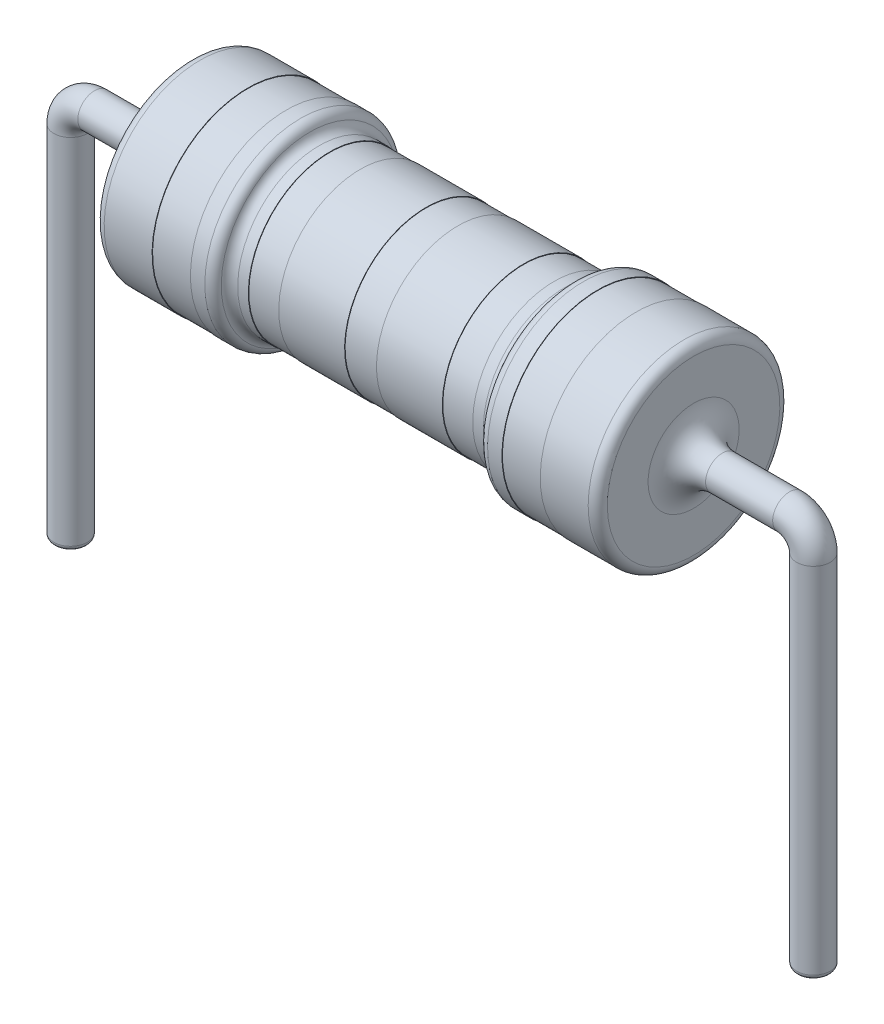
ISO-10303-21;
HEADER;
FILE_DESCRIPTION(('STEP AP214'),'2;1');
FILE_NAME('part.step','',(''),(''),'','','');
FILE_SCHEMA(('AUTOMOTIVE_DESIGN { 1 0 10303 214 1 1 1 1 }'));
ENDSEC;
DATA;
#1=APPLICATION_CONTEXT('core data for automotive mechanical design processes');
#2=APPLICATION_PROTOCOL_DEFINITION('international standard','automotive_design',2000,#1);
#3=PRODUCT_CONTEXT('',#1,'mechanical');
#4=PRODUCT('Part','Part','',(#3));
#5=PRODUCT_RELATED_PRODUCT_CATEGORY('part','',(#4));
#6=PRODUCT_DEFINITION_FORMATION('','',#4);
#7=PRODUCT_DEFINITION_CONTEXT('part definition',#1,'design');
#8=PRODUCT_DEFINITION('design','',#6,#7);
#9=PRODUCT_DEFINITION_SHAPE('','',#8);
#10=(LENGTH_UNIT() NAMED_UNIT(*) SI_UNIT(.MILLI.,.METRE.));
#11=(NAMED_UNIT(*) PLANE_ANGLE_UNIT() SI_UNIT($,.RADIAN.));
#12=(NAMED_UNIT(*) SI_UNIT($,.STERADIAN.) SOLID_ANGLE_UNIT());
#13=UNCERTAINTY_MEASURE_WITH_UNIT(LENGTH_MEASURE(1.E-05),#10,'distance_accuracy_value','');
#14=(GEOMETRIC_REPRESENTATION_CONTEXT(3) GLOBAL_UNCERTAINTY_ASSIGNED_CONTEXT((#13)) GLOBAL_UNIT_ASSIGNED_CONTEXT((#10,
#11,#12)) REPRESENTATION_CONTEXT('',''));
#15=CARTESIAN_POINT('',(0.,0.,0.));
#16=DIRECTION('',(0.,0.,1.));
#17=DIRECTION('',(1.,0.,0.));
#18=AXIS2_PLACEMENT_3D('',#15,#16,#17);
#19=CARTESIAN_POINT('',(5.25,0.,0.));
#20=DIRECTION('',(1.,0.,0.));
#21=DIRECTION('',(0.,1.,0.));
#22=AXIS2_PLACEMENT_3D('',#19,#20,#21);
#23=PLANE('',#22);
#24=CARTESIAN_POINT('',(5.25,0.,0.));
#25=DIRECTION('',(1.,0.,0.));
#26=DIRECTION('',(0.,1.,0.));
#27=AXIS2_PLACEMENT_3D('',#24,#25,#26);
#28=CIRCLE('',#27,0.95);
#29=CARTESIAN_POINT('',(5.25,0.95,0.));
#30=VERTEX_POINT('',#29);
#31=EDGE_CURVE('E51',#30,#30,#28,.F.);
#32=ORIENTED_EDGE('',*,*,#31,.T.);
#33=EDGE_LOOP('',(#32));
#34=FACE_BOUND('',#33,.T.);
#35=CARTESIAN_POINT('',(5.25,0.,0.));
#36=DIRECTION('',(1.,0.,0.));
#37=DIRECTION('',(0.,1.,0.));
#38=AXIS2_PLACEMENT_3D('',#35,#36,#37);
#39=CIRCLE('',#38,1.8);
#40=CARTESIAN_POINT('',(5.25,1.8,0.));
#41=VERTEX_POINT('',#40);
#42=EDGE_CURVE('E79',#41,#41,#39,.T.);
#43=ORIENTED_EDGE('',*,*,#42,.T.);
#44=EDGE_LOOP('',(#43));
#45=FACE_BOUND('',#44,.T.);
#46=ADVANCED_FACE('F36',(#34,#45),#23,.T.);
#47=CARTESIAN_POINT('',(-5.25,0.,0.));
#48=DIRECTION('',(-1.,0.,0.));
#49=DIRECTION('',(0.,-1.,0.));
#50=AXIS2_PLACEMENT_3D('',#47,#48,#49);
#51=CYLINDRICAL_SURFACE('',#50,2.);
#52=CARTESIAN_POINT('',(5.05,0.,0.));
#53=DIRECTION('',(1.,0.,0.));
#54=DIRECTION('',(0.,1.,0.));
#55=AXIS2_PLACEMENT_3D('',#52,#53,#54);
#56=CIRCLE('',#55,2.);
#57=CARTESIAN_POINT('',(5.05,2.,0.));
#58=VERTEX_POINT('',#57);
#59=EDGE_CURVE('E83',#58,#58,#56,.F.);
#60=ORIENTED_EDGE('',*,*,#59,.T.);
#61=EDGE_LOOP('',(#60));
#62=FACE_BOUND('',#61,.T.);
#63=CARTESIAN_POINT('',(4.05,0.,0.));
#64=DIRECTION('',(-1.,0.,0.));
#65=DIRECTION('',(0.,-1.,0.));
#66=AXIS2_PLACEMENT_3D('',#63,#64,#65);
#67=CIRCLE('',#66,2.);
#68=CARTESIAN_POINT('',(4.05,-2.,0.));
#69=VERTEX_POINT('',#68);
#70=EDGE_CURVE('E118',#69,#69,#67,.T.);
#71=ORIENTED_EDGE('',*,*,#70,.F.);
#72=EDGE_LOOP('',(#71));
#73=FACE_BOUND('',#72,.T.);
#74=ADVANCED_FACE('F233',(#62,#73),#51,.T.);
#75=CARTESIAN_POINT('',(4.05,-2.,0.));
#76=DIRECTION('',(-1.,0.,0.));
#77=DIRECTION('',(0.,-1.,0.));
#78=AXIS2_PLACEMENT_3D('',#75,#76,#77);
#79=PLANE('',#78);
#80=ORIENTED_EDGE('',*,*,#70,.T.);
#81=EDGE_LOOP('',(#80));
#82=FACE_BOUND('',#81,.T.);
#83=CARTESIAN_POINT('',(4.05,0.,0.));
#84=DIRECTION('',(-1.,0.,0.));
#85=DIRECTION('',(0.,-1.,0.));
#86=AXIS2_PLACEMENT_3D('',#83,#84,#85);
#87=CIRCLE('',#86,1.99);
#88=CARTESIAN_POINT('',(4.05,-1.99,0.));
#89=VERTEX_POINT('',#88);
#90=EDGE_CURVE('E122',#89,#89,#87,.T.);
#91=ORIENTED_EDGE('',*,*,#90,.F.);
#92=EDGE_LOOP('',(#91));
#93=FACE_BOUND('',#92,.T.);
#94=ADVANCED_FACE('F239',(#82,#93),#79,.T.);
#95=CARTESIAN_POINT('',(-5.25,0.,0.));
#96=DIRECTION('',(-1.,0.,0.));
#97=DIRECTION('',(0.,-1.,0.));
#98=AXIS2_PLACEMENT_3D('',#95,#96,#97);
#99=CYLINDRICAL_SURFACE('',#98,1.99);
#100=ORIENTED_EDGE('',*,*,#90,.T.);
#101=EDGE_LOOP('',(#100));
#102=FACE_BOUND('',#101,.T.);
#103=CARTESIAN_POINT('',(3.25,0.,0.));
#104=DIRECTION('',(-1.,0.,0.));
#105=DIRECTION('',(0.,-1.,0.));
#106=AXIS2_PLACEMENT_3D('',#103,#104,#105);
#107=CIRCLE('',#106,1.99);
#108=CARTESIAN_POINT('',(3.25,-1.99,0.));
#109=VERTEX_POINT('',#108);
#110=EDGE_CURVE('E126',#109,#109,#107,.T.);
#111=ORIENTED_EDGE('',*,*,#110,.F.);
#112=EDGE_LOOP('',(#111));
#113=FACE_BOUND('',#112,.T.);
#114=ADVANCED_FACE('F388',(#102,#113),#99,.T.);
#115=CARTESIAN_POINT('',(3.25,-1.99,0.));
#116=DIRECTION('',(1.,0.,0.));
#117=DIRECTION('',(0.,1.,0.));
#118=AXIS2_PLACEMENT_3D('',#115,#116,#117);
#119=PLANE('',#118);
#120=ORIENTED_EDGE('',*,*,#110,.T.);
#121=EDGE_LOOP('',(#120));
#122=FACE_BOUND('',#121,.T.);
#123=CARTESIAN_POINT('',(3.25,0.,0.));
#124=DIRECTION('',(-1.,0.,0.));
#125=DIRECTION('',(0.,-1.,0.));
#126=AXIS2_PLACEMENT_3D('',#123,#124,#125);
#127=CIRCLE('',#126,2.);
#128=CARTESIAN_POINT('',(3.25,-2.,0.));
#129=VERTEX_POINT('',#128);
#130=EDGE_CURVE('E130',#129,#129,#127,.T.);
#131=ORIENTED_EDGE('',*,*,#130,.F.);
#132=EDGE_LOOP('',(#131));
#133=FACE_BOUND('',#132,.T.);
#134=ADVANCED_FACE('F384',(#122,#133),#119,.T.);
#135=CARTESIAN_POINT('',(-5.25,0.,0.));
#136=DIRECTION('',(-1.,0.,0.));
#137=DIRECTION('',(0.,-1.,0.));
#138=AXIS2_PLACEMENT_3D('',#135,#136,#137);
#139=CYLINDRICAL_SURFACE('',#138,2.);
#140=CARTESIAN_POINT('',(2.95,0.,0.));
#141=DIRECTION('',(-1.,0.,0.));
#142=DIRECTION('',(0.,-1.,0.));
#143=AXIS2_PLACEMENT_3D('',#140,#141,#142);
#144=CIRCLE('',#143,2.);
#145=CARTESIAN_POINT('',(2.95,-2.,0.));
#146=VERTEX_POINT('',#145);
#147=EDGE_CURVE('E102',#146,#146,#144,.F.);
#148=ORIENTED_EDGE('',*,*,#147,.T.);
#149=EDGE_LOOP('',(#148));
#150=FACE_BOUND('',#149,.T.);
#151=ORIENTED_EDGE('',*,*,#130,.T.);
#152=EDGE_LOOP('',(#151));
#153=FACE_BOUND('',#152,.T.);
#154=ADVANCED_FACE('F380',(#150,#153),#139,.T.);
#155=CARTESIAN_POINT('',(-5.25,0.,0.));
#156=DIRECTION('',(-1.,0.,0.));
#157=DIRECTION('',(0.,-1.,0.));
#158=AXIS2_PLACEMENT_3D('',#155,#156,#157);
#159=CYLINDRICAL_SURFACE('',#158,1.7);
#160=CARTESIAN_POINT('',(2.5627016653792,0.,0.));
#161=DIRECTION('',(-1.,0.,0.));
#162=DIRECTION('',(0.,-1.,0.));
#163=AXIS2_PLACEMENT_3D('',#160,#161,#162);
#164=CIRCLE('',#163,1.7);
#165=CARTESIAN_POINT('',(2.5627016653792,-1.7,0.));
#166=VERTEX_POINT('',#165);
#167=EDGE_CURVE('E99',#166,#166,#164,.T.);
#168=ORIENTED_EDGE('',*,*,#167,.T.);
#169=EDGE_LOOP('',(#168));
#170=FACE_BOUND('',#169,.T.);
#171=CARTESIAN_POINT('',(2.34069006093189,0.,0.));
#172=DIRECTION('',(-1.,0.,0.));
#173=DIRECTION('',(0.,-1.,0.));
#174=AXIS2_PLACEMENT_3D('',#171,#172,#173);
#175=CIRCLE('',#174,1.7);
#176=CARTESIAN_POINT('',(2.34069006093189,-1.7,0.));
#177=VERTEX_POINT('',#176);
#178=EDGE_CURVE('E134',#177,#177,#175,.T.);
#179=ORIENTED_EDGE('',*,*,#178,.F.);
#180=EDGE_LOOP('',(#179));
#181=FACE_BOUND('',#180,.T.);
#182=ADVANCED_FACE('F376',(#170,#181),#159,.T.);
#183=CARTESIAN_POINT('',(2.3406900609319,-1.7,0.));
#184=DIRECTION('',(-1.,0.,0.));
#185=DIRECTION('',(0.,-1.,0.));
#186=AXIS2_PLACEMENT_3D('',#183,#184,#185);
#187=PLANE('',#186);
#188=ORIENTED_EDGE('',*,*,#178,.T.);
#189=EDGE_LOOP('',(#188));
#190=FACE_BOUND('',#189,.T.);
#191=CARTESIAN_POINT('',(2.34069006093189,0.,0.));
#192=DIRECTION('',(-1.,0.,0.));
#193=DIRECTION('',(0.,-1.,0.));
#194=AXIS2_PLACEMENT_3D('',#191,#192,#193);
#195=CIRCLE('',#194,1.69);
#196=CARTESIAN_POINT('',(2.34069006093189,-1.69,0.));
#197=VERTEX_POINT('',#196);
#198=EDGE_CURVE('E138',#197,#197,#195,.T.);
#199=ORIENTED_EDGE('',*,*,#198,.F.);
#200=EDGE_LOOP('',(#199));
#201=FACE_BOUND('',#200,.T.);
#202=ADVANCED_FACE('F372',(#190,#201),#187,.T.);
#203=CARTESIAN_POINT('',(-5.25,0.,0.));
#204=DIRECTION('',(-1.,0.,0.));
#205=DIRECTION('',(0.,-1.,0.));
#206=AXIS2_PLACEMENT_3D('',#203,#204,#205);
#207=CYLINDRICAL_SURFACE('',#206,1.69);
#208=ORIENTED_EDGE('',*,*,#198,.T.);
#209=EDGE_LOOP('',(#208));
#210=FACE_BOUND('',#209,.T.);
#211=CARTESIAN_POINT('',(1.70680528042174,0.,0.));
#212=DIRECTION('',(-1.,0.,0.));
#213=DIRECTION('',(0.,-1.,0.));
#214=AXIS2_PLACEMENT_3D('',#211,#212,#213);
#215=CIRCLE('',#214,1.69);
#216=CARTESIAN_POINT('',(1.70680528042174,-1.69,0.));
#217=VERTEX_POINT('',#216);
#218=EDGE_CURVE('E142',#217,#217,#215,.T.);
#219=ORIENTED_EDGE('',*,*,#218,.F.);
#220=EDGE_LOOP('',(#219));
#221=FACE_BOUND('',#220,.T.);
#222=ADVANCED_FACE('F368',(#210,#221),#207,.T.);
#223=CARTESIAN_POINT('',(1.70680528042174,-1.69,0.));
#224=DIRECTION('',(1.,0.,0.));
#225=DIRECTION('',(0.,1.,0.));
#226=AXIS2_PLACEMENT_3D('',#223,#224,#225);
#227=PLANE('',#226);
#228=ORIENTED_EDGE('',*,*,#218,.T.);
#229=EDGE_LOOP('',(#228));
#230=FACE_BOUND('',#229,.T.);
#231=CARTESIAN_POINT('',(1.70680528042174,0.,0.));
#232=DIRECTION('',(-1.,0.,0.));
#233=DIRECTION('',(0.,-1.,0.));
#234=AXIS2_PLACEMENT_3D('',#231,#232,#233);
#235=CIRCLE('',#234,1.7);
#236=CARTESIAN_POINT('',(1.70680528042174,-1.7,0.));
#237=VERTEX_POINT('',#236);
#238=EDGE_CURVE('E146',#237,#237,#235,.T.);
#239=ORIENTED_EDGE('',*,*,#238,.F.);
#240=EDGE_LOOP('',(#239));
#241=FACE_BOUND('',#240,.T.);
#242=ADVANCED_FACE('F364',(#230,#241),#227,.T.);
#243=CARTESIAN_POINT('',(-5.25,0.,0.));
#244=DIRECTION('',(-1.,0.,0.));
#245=DIRECTION('',(0.,-1.,0.));
#246=AXIS2_PLACEMENT_3D('',#243,#244,#245);
#247=CYLINDRICAL_SURFACE('',#246,1.7);
#248=ORIENTED_EDGE('',*,*,#238,.T.);
#249=EDGE_LOOP('',(#248));
#250=FACE_BOUND('',#249,.T.);
#251=CARTESIAN_POINT('',(0.332543076275725,0.,0.));
#252=DIRECTION('',(-1.,0.,0.));
#253=DIRECTION('',(0.,-1.,0.));
#254=AXIS2_PLACEMENT_3D('',#251,#252,#253);
#255=CIRCLE('',#254,1.7);
#256=CARTESIAN_POINT('',(0.332543076275725,-1.7,0.));
#257=VERTEX_POINT('',#256);
#258=EDGE_CURVE('E150',#257,#257,#255,.T.);
#259=ORIENTED_EDGE('',*,*,#258,.F.);
#260=EDGE_LOOP('',(#259));
#261=FACE_BOUND('',#260,.T.);
#262=ADVANCED_FACE('F360',(#250,#261),#247,.T.);
#263=CARTESIAN_POINT('',(0.332543076275725,-1.7,0.));
#264=DIRECTION('',(-1.,0.,0.));
#265=DIRECTION('',(0.,-1.,0.));
#266=AXIS2_PLACEMENT_3D('',#263,#264,#265);
#267=PLANE('',#266);
#268=ORIENTED_EDGE('',*,*,#258,.T.);
#269=EDGE_LOOP('',(#268));
#270=FACE_BOUND('',#269,.T.);
#271=CARTESIAN_POINT('',(0.332543076275725,0.,0.));
#272=DIRECTION('',(-1.,0.,0.));
#273=DIRECTION('',(0.,-1.,0.));
#274=AXIS2_PLACEMENT_3D('',#271,#272,#273);
#275=CIRCLE('',#274,1.69);
#276=CARTESIAN_POINT('',(0.332543076275725,-1.69,0.));
#277=VERTEX_POINT('',#276);
#278=EDGE_CURVE('E154',#277,#277,#275,.T.);
#279=ORIENTED_EDGE('',*,*,#278,.F.);
#280=EDGE_LOOP('',(#279));
#281=FACE_BOUND('',#280,.T.);
#282=ADVANCED_FACE('F356',(#270,#281),#267,.T.);
#283=CARTESIAN_POINT('',(-5.25,0.,0.));
#284=DIRECTION('',(-1.,0.,0.));
#285=DIRECTION('',(0.,-1.,0.));
#286=AXIS2_PLACEMENT_3D('',#283,#284,#285);
#287=CYLINDRICAL_SURFACE('',#286,1.69);
#288=ORIENTED_EDGE('',*,*,#278,.T.);
#289=EDGE_LOOP('',(#288));
#290=FACE_BOUND('',#289,.T.);
#291=CARTESIAN_POINT('',(-0.332543076275725,0.,0.));
#292=DIRECTION('',(-1.,0.,0.));
#293=DIRECTION('',(0.,-1.,0.));
#294=AXIS2_PLACEMENT_3D('',#291,#292,#293);
#295=CIRCLE('',#294,1.69);
#296=CARTESIAN_POINT('',(-0.332543076275725,-1.69,0.));
#297=VERTEX_POINT('',#296);
#298=EDGE_CURVE('E158',#297,#297,#295,.T.);
#299=ORIENTED_EDGE('',*,*,#298,.F.);
#300=EDGE_LOOP('',(#299));
#301=FACE_BOUND('',#300,.T.);
#302=ADVANCED_FACE('F352',(#290,#301),#287,.T.);
#303=CARTESIAN_POINT('',(-0.332543076275725,-1.7,0.));
#304=DIRECTION('',(1.,0.,0.));
#305=DIRECTION('',(0.,1.,0.));
#306=AXIS2_PLACEMENT_3D('',#303,#304,#305);
#307=PLANE('',#306);
#308=ORIENTED_EDGE('',*,*,#298,.T.);
#309=EDGE_LOOP('',(#308));
#310=FACE_BOUND('',#309,.T.);
#311=CARTESIAN_POINT('',(-0.332543076275725,0.,0.));
#312=DIRECTION('',(-1.,0.,0.));
#313=DIRECTION('',(0.,-1.,0.));
#314=AXIS2_PLACEMENT_3D('',#311,#312,#313);
#315=CIRCLE('',#314,1.7);
#316=CARTESIAN_POINT('',(-0.332543076275725,-1.7,0.));
#317=VERTEX_POINT('',#316);
#318=EDGE_CURVE('E162',#317,#317,#315,.T.);
#319=ORIENTED_EDGE('',*,*,#318,.F.);
#320=EDGE_LOOP('',(#319));
#321=FACE_BOUND('',#320,.T.);
#322=ADVANCED_FACE('F348',(#310,#321),#307,.T.);
#323=CARTESIAN_POINT('',(-5.25,0.,0.));
#324=DIRECTION('',(-1.,0.,0.));
#325=DIRECTION('',(0.,-1.,0.));
#326=AXIS2_PLACEMENT_3D('',#323,#324,#325);
#327=CYLINDRICAL_SURFACE('',#326,1.7);
#328=ORIENTED_EDGE('',*,*,#318,.T.);
#329=EDGE_LOOP('',(#328));
#330=FACE_BOUND('',#329,.T.);
#331=CARTESIAN_POINT('',(-1.70680528042174,0.,0.));
#332=DIRECTION('',(-1.,0.,0.));
#333=DIRECTION('',(0.,-1.,0.));
#334=AXIS2_PLACEMENT_3D('',#331,#332,#333);
#335=CIRCLE('',#334,1.7);
#336=CARTESIAN_POINT('',(-1.70680528042174,-1.7,0.));
#337=VERTEX_POINT('',#336);
#338=EDGE_CURVE('E166',#337,#337,#335,.T.);
#339=ORIENTED_EDGE('',*,*,#338,.F.);
#340=EDGE_LOOP('',(#339));
#341=FACE_BOUND('',#340,.T.);
#342=ADVANCED_FACE('F344',(#330,#341),#327,.T.);
#343=CARTESIAN_POINT('',(-1.70680528042174,-1.69,0.));
#344=DIRECTION('',(-1.,0.,0.));
#345=DIRECTION('',(0.,-1.,0.));
#346=AXIS2_PLACEMENT_3D('',#343,#344,#345);
#347=PLANE('',#346);
#348=ORIENTED_EDGE('',*,*,#338,.T.);
#349=EDGE_LOOP('',(#348));
#350=FACE_BOUND('',#349,.T.);
#351=CARTESIAN_POINT('',(-1.70680528042174,0.,0.));
#352=DIRECTION('',(-1.,0.,0.));
#353=DIRECTION('',(0.,-1.,0.));
#354=AXIS2_PLACEMENT_3D('',#351,#352,#353);
#355=CIRCLE('',#354,1.69);
#356=CARTESIAN_POINT('',(-1.70680528042174,-1.69,0.));
#357=VERTEX_POINT('',#356);
#358=EDGE_CURVE('E170',#357,#357,#355,.T.);
#359=ORIENTED_EDGE('',*,*,#358,.F.);
#360=EDGE_LOOP('',(#359));
#361=FACE_BOUND('',#360,.T.);
#362=ADVANCED_FACE('F340',(#350,#361),#347,.T.);
#363=CARTESIAN_POINT('',(-5.25,0.,0.));
#364=DIRECTION('',(-1.,0.,0.));
#365=DIRECTION('',(0.,-1.,0.));
#366=AXIS2_PLACEMENT_3D('',#363,#364,#365);
#367=CYLINDRICAL_SURFACE('',#366,1.69);
#368=ORIENTED_EDGE('',*,*,#358,.T.);
#369=EDGE_LOOP('',(#368));
#370=FACE_BOUND('',#369,.T.);
#371=CARTESIAN_POINT('',(-2.3406900609319,0.,0.));
#372=DIRECTION('',(-1.,0.,0.));
#373=DIRECTION('',(0.,-1.,0.));
#374=AXIS2_PLACEMENT_3D('',#371,#372,#373);
#375=CIRCLE('',#374,1.69);
#376=CARTESIAN_POINT('',(-2.3406900609319,-1.69,0.));
#377=VERTEX_POINT('',#376);
#378=EDGE_CURVE('E174',#377,#377,#375,.T.);
#379=ORIENTED_EDGE('',*,*,#378,.F.);
#380=EDGE_LOOP('',(#379));
#381=FACE_BOUND('',#380,.T.);
#382=ADVANCED_FACE('F336',(#370,#381),#367,.T.);
#383=CARTESIAN_POINT('',(-2.3406900609319,-1.7,0.));
#384=DIRECTION('',(1.,0.,0.));
#385=DIRECTION('',(0.,1.,0.));
#386=AXIS2_PLACEMENT_3D('',#383,#384,#385);
#387=PLANE('',#386);
#388=ORIENTED_EDGE('',*,*,#378,.T.);
#389=EDGE_LOOP('',(#388));
#390=FACE_BOUND('',#389,.T.);
#391=CARTESIAN_POINT('',(-2.3406900609319,0.,0.));
#392=DIRECTION('',(-1.,0.,0.));
#393=DIRECTION('',(0.,-1.,0.));
#394=AXIS2_PLACEMENT_3D('',#391,#392,#393);
#395=CIRCLE('',#394,1.7);
#396=CARTESIAN_POINT('',(-2.3406900609319,-1.7,0.));
#397=VERTEX_POINT('',#396);
#398=EDGE_CURVE('E178',#397,#397,#395,.T.);
#399=ORIENTED_EDGE('',*,*,#398,.F.);
#400=EDGE_LOOP('',(#399));
#401=FACE_BOUND('',#400,.T.);
#402=ADVANCED_FACE('F332',(#390,#401),#387,.T.);
#403=CARTESIAN_POINT('',(-5.25,0.,0.));
#404=DIRECTION('',(-1.,0.,0.));
#405=DIRECTION('',(0.,-1.,0.));
#406=AXIS2_PLACEMENT_3D('',#403,#404,#405);
#407=CYLINDRICAL_SURFACE('',#406,1.7);
#408=CARTESIAN_POINT('',(-2.56270166537917,0.,0.));
#409=DIRECTION('',(-1.,0.,0.));
#410=DIRECTION('',(0.,-1.,0.));
#411=AXIS2_PLACEMENT_3D('',#408,#409,#410);
#412=CIRCLE('',#411,1.7);
#413=CARTESIAN_POINT('',(-2.56270166537917,-1.7,0.));
#414=VERTEX_POINT('',#413);
#415=EDGE_CURVE('E106',#414,#414,#412,.F.);
#416=ORIENTED_EDGE('',*,*,#415,.T.);
#417=EDGE_LOOP('',(#416));
#418=FACE_BOUND('',#417,.T.);
#419=ORIENTED_EDGE('',*,*,#398,.T.);
#420=EDGE_LOOP('',(#419));
#421=FACE_BOUND('',#420,.T.);
#422=ADVANCED_FACE('F328',(#418,#421),#407,.T.);
#423=CARTESIAN_POINT('',(-5.25,0.,0.));
#424=DIRECTION('',(-1.,0.,0.));
#425=DIRECTION('',(0.,-1.,0.));
#426=AXIS2_PLACEMENT_3D('',#423,#424,#425);
#427=CYLINDRICAL_SURFACE('',#426,2.);
#428=CARTESIAN_POINT('',(-2.95,0.,0.));
#429=DIRECTION('',(1.,0.,0.));
#430=DIRECTION('',(0.,1.,0.));
#431=AXIS2_PLACEMENT_3D('',#428,#429,#430);
#432=CIRCLE('',#431,2.);
#433=CARTESIAN_POINT('',(-2.95,2.,0.));
#434=VERTEX_POINT('',#433);
#435=EDGE_CURVE('E114',#434,#434,#432,.F.);
#436=ORIENTED_EDGE('',*,*,#435,.T.);
#437=EDGE_LOOP('',(#436));
#438=FACE_BOUND('',#437,.T.);
#439=CARTESIAN_POINT('',(-3.25,0.,0.));
#440=DIRECTION('',(-1.,0.,0.));
#441=DIRECTION('',(0.,-1.,0.));
#442=AXIS2_PLACEMENT_3D('',#439,#440,#441);
#443=CIRCLE('',#442,2.);
#444=CARTESIAN_POINT('',(-3.25,-2.,0.));
#445=VERTEX_POINT('',#444);
#446=EDGE_CURVE('E182',#445,#445,#443,.T.);
#447=ORIENTED_EDGE('',*,*,#446,.F.);
#448=EDGE_LOOP('',(#447));
#449=FACE_BOUND('',#448,.T.);
#450=ADVANCED_FACE('F324',(#438,#449),#427,.T.);
#451=CARTESIAN_POINT('',(-3.25,-1.99,0.));
#452=DIRECTION('',(-1.,0.,0.));
#453=DIRECTION('',(0.,-1.,0.));
#454=AXIS2_PLACEMENT_3D('',#451,#452,#453);
#455=PLANE('',#454);
#456=ORIENTED_EDGE('',*,*,#446,.T.);
#457=EDGE_LOOP('',(#456));
#458=FACE_BOUND('',#457,.T.);
#459=CARTESIAN_POINT('',(-3.25,0.,0.));
#460=DIRECTION('',(-1.,0.,0.));
#461=DIRECTION('',(0.,-1.,0.));
#462=AXIS2_PLACEMENT_3D('',#459,#460,#461);
#463=CIRCLE('',#462,1.99);
#464=CARTESIAN_POINT('',(-3.25,-1.99,0.));
#465=VERTEX_POINT('',#464);
#466=EDGE_CURVE('E186',#465,#465,#463,.T.);
#467=ORIENTED_EDGE('',*,*,#466,.F.);
#468=EDGE_LOOP('',(#467));
#469=FACE_BOUND('',#468,.T.);
#470=ADVANCED_FACE('F320',(#458,#469),#455,.T.);
#471=CARTESIAN_POINT('',(-5.25,0.,0.));
#472=DIRECTION('',(-1.,0.,0.));
#473=DIRECTION('',(0.,-1.,0.));
#474=AXIS2_PLACEMENT_3D('',#471,#472,#473);
#475=CYLINDRICAL_SURFACE('',#474,1.99);
#476=ORIENTED_EDGE('',*,*,#466,.T.);
#477=EDGE_LOOP('',(#476));
#478=FACE_BOUND('',#477,.T.);
#479=CARTESIAN_POINT('',(-4.05,0.,0.));
#480=DIRECTION('',(-1.,0.,0.));
#481=DIRECTION('',(0.,-1.,0.));
#482=AXIS2_PLACEMENT_3D('',#479,#480,#481);
#483=CIRCLE('',#482,1.99);
#484=CARTESIAN_POINT('',(-4.05,-1.99,0.));
#485=VERTEX_POINT('',#484);
#486=EDGE_CURVE('E190',#485,#485,#483,.T.);
#487=ORIENTED_EDGE('',*,*,#486,.F.);
#488=EDGE_LOOP('',(#487));
#489=FACE_BOUND('',#488,.T.);
#490=ADVANCED_FACE('F316',(#478,#489),#475,.T.);
#491=CARTESIAN_POINT('',(-4.05,-2.,0.));
#492=DIRECTION('',(1.,0.,0.));
#493=DIRECTION('',(0.,1.,0.));
#494=AXIS2_PLACEMENT_3D('',#491,#492,#493);
#495=PLANE('',#494);
#496=ORIENTED_EDGE('',*,*,#486,.T.);
#497=EDGE_LOOP('',(#496));
#498=FACE_BOUND('',#497,.T.);
#499=CARTESIAN_POINT('',(-4.05,0.,0.));
#500=DIRECTION('',(-1.,0.,0.));
#501=DIRECTION('',(0.,-1.,0.));
#502=AXIS2_PLACEMENT_3D('',#499,#500,#501);
#503=CIRCLE('',#502,2.);
#504=CARTESIAN_POINT('',(-4.05,-2.,0.));
#505=VERTEX_POINT('',#504);
#506=EDGE_CURVE('E194',#505,#505,#503,.T.);
#507=ORIENTED_EDGE('',*,*,#506,.F.);
#508=EDGE_LOOP('',(#507));
#509=FACE_BOUND('',#508,.T.);
#510=ADVANCED_FACE('F312',(#498,#509),#495,.T.);
#511=CARTESIAN_POINT('',(-5.25,0.,0.));
#512=DIRECTION('',(-1.,0.,0.));
#513=DIRECTION('',(0.,-1.,0.));
#514=AXIS2_PLACEMENT_3D('',#511,#512,#513);
#515=CYLINDRICAL_SURFACE('',#514,2.);
#516=CARTESIAN_POINT('',(-5.05,0.,0.));
#517=DIRECTION('',(-1.,0.,0.));
#518=DIRECTION('',(0.,-1.,0.));
#519=AXIS2_PLACEMENT_3D('',#516,#517,#518);
#520=CIRCLE('',#519,2.);
#521=CARTESIAN_POINT('',(-5.05,-2.,0.));
#522=VERTEX_POINT('',#521);
#523=EDGE_CURVE('E87',#522,#522,#520,.F.);
#524=ORIENTED_EDGE('',*,*,#523,.T.);
#525=EDGE_LOOP('',(#524));
#526=FACE_BOUND('',#525,.T.);
#527=ORIENTED_EDGE('',*,*,#506,.T.);
#528=EDGE_LOOP('',(#527));
#529=FACE_BOUND('',#528,.T.);
#530=ADVANCED_FACE('F309',(#526,#529),#515,.T.);
#531=CARTESIAN_POINT('',(-5.25,0.,0.));
#532=DIRECTION('',(-1.,0.,0.));
#533=DIRECTION('',(0.,-1.,0.));
#534=AXIS2_PLACEMENT_3D('',#531,#532,#533);
#535=PLANE('',#534);
#536=CARTESIAN_POINT('',(-5.25,0.,0.));
#537=DIRECTION('',(-1.,0.,0.));
#538=DIRECTION('',(0.,-1.,0.));
#539=AXIS2_PLACEMENT_3D('',#536,#537,#538);
#540=CIRCLE('',#539,0.95);
#541=CARTESIAN_POINT('',(-5.25,-0.95,0.));
#542=VERTEX_POINT('',#541);
#543=EDGE_CURVE('E10',#542,#542,#540,.F.);
#544=ORIENTED_EDGE('',*,*,#543,.T.);
#545=EDGE_LOOP('',(#544));
#546=FACE_BOUND('',#545,.T.);
#547=CARTESIAN_POINT('',(-5.25,0.,0.));
#548=DIRECTION('',(-1.,0.,0.));
#549=DIRECTION('',(0.,-1.,0.));
#550=AXIS2_PLACEMENT_3D('',#547,#548,#549);
#551=CIRCLE('',#550,1.8);
#552=CARTESIAN_POINT('',(-5.25,-1.8,0.));
#553=VERTEX_POINT('',#552);
#554=EDGE_CURVE('E91',#553,#553,#551,.T.);
#555=ORIENTED_EDGE('',*,*,#554,.T.);
#556=EDGE_LOOP('',(#555));
#557=FACE_BOUND('',#556,.T.);
#558=ADVANCED_FACE('F249',(#546,#557),#535,.T.);
#559=CARTESIAN_POINT('',(-2.95,0.,0.));
#560=DIRECTION('',(1.,0.,0.));
#561=DIRECTION('',(0.,1.,0.));
#562=AXIS2_PLACEMENT_3D('',#559,#560,#561);
#563=TOROIDAL_SURFACE('',#562,1.8,0.2);
#564=CARTESIAN_POINT('',(-2.75635083268959,0.,0.));
#565=DIRECTION('',(-1.,0.,0.));
#566=DIRECTION('',(0.,-1.,0.));
#567=AXIS2_PLACEMENT_3D('',#564,#565,#566);
#568=CIRCLE('',#567,1.84999999999999);
#569=CARTESIAN_POINT('',(-2.75635083268959,-1.84999999999999,0.));
#570=VERTEX_POINT('',#569);
#571=EDGE_CURVE('E110',#570,#570,#568,.T.);
#572=ORIENTED_EDGE('',*,*,#571,.T.);
#573=EDGE_LOOP('',(#572));
#574=FACE_BOUND('',#573,.T.);
#575=ORIENTED_EDGE('',*,*,#435,.F.);
#576=EDGE_LOOP('',(#575));
#577=FACE_BOUND('',#576,.T.);
#578=ADVANCED_FACE('F245',(#574,#577),#563,.T.);
#579=CARTESIAN_POINT('',(-2.56270166537917,0.,0.));
#580=DIRECTION('',(-1.,0.,0.));
#581=DIRECTION('',(0.,-1.,0.));
#582=AXIS2_PLACEMENT_3D('',#579,#580,#581);
#583=TOROIDAL_SURFACE('',#582,1.89999999999998,0.2);
#584=ORIENTED_EDGE('',*,*,#415,.F.);
#585=EDGE_LOOP('',(#584));
#586=FACE_BOUND('',#585,.T.);
#587=ORIENTED_EDGE('',*,*,#571,.F.);
#588=EDGE_LOOP('',(#587));
#589=FACE_BOUND('',#588,.T.);
#590=ADVANCED_FACE('F248',(#586,#589),#583,.F.);
#591=CARTESIAN_POINT('',(2.95,0.,0.));
#592=DIRECTION('',(-1.,0.,0.));
#593=DIRECTION('',(0.,-1.,0.));
#594=AXIS2_PLACEMENT_3D('',#591,#592,#593);
#595=TOROIDAL_SURFACE('',#594,1.8,0.2);
#596=CARTESIAN_POINT('',(2.75635083268959,0.,0.));
#597=DIRECTION('',(1.,0.,0.));
#598=DIRECTION('',(0.,1.,0.));
#599=AXIS2_PLACEMENT_3D('',#596,#597,#598);
#600=CIRCLE('',#599,1.85);
#601=CARTESIAN_POINT('',(2.75635083268959,1.85,0.));
#602=VERTEX_POINT('',#601);
#603=EDGE_CURVE('E95',#602,#602,#600,.T.);
#604=ORIENTED_EDGE('',*,*,#603,.T.);
#605=EDGE_LOOP('',(#604));
#606=FACE_BOUND('',#605,.T.);
#607=ORIENTED_EDGE('',*,*,#147,.F.);
#608=EDGE_LOOP('',(#607));
#609=FACE_BOUND('',#608,.T.);
#610=ADVANCED_FACE('F253',(#606,#609),#595,.T.);
#611=CARTESIAN_POINT('',(2.5627016653792,0.,0.));
#612=DIRECTION('',(-1.,0.,0.));
#613=DIRECTION('',(0.,-1.,0.));
#614=AXIS2_PLACEMENT_3D('',#611,#612,#613);
#615=TOROIDAL_SURFACE('',#614,1.89999999999999,0.2);
#616=ORIENTED_EDGE('',*,*,#603,.F.);
#617=EDGE_LOOP('',(#616));
#618=FACE_BOUND('',#617,.T.);
#619=ORIENTED_EDGE('',*,*,#167,.F.);
#620=EDGE_LOOP('',(#619));
#621=FACE_BOUND('',#620,.T.);
#622=ADVANCED_FACE('F257',(#618,#621),#615,.F.);
#623=CARTESIAN_POINT('',(-5.05,0.,0.));
#624=DIRECTION('',(-1.,0.,0.));
#625=DIRECTION('',(0.,-1.,0.));
#626=AXIS2_PLACEMENT_3D('',#623,#624,#625);
#627=TOROIDAL_SURFACE('',#626,1.8,0.2);
#628=ORIENTED_EDGE('',*,*,#523,.F.);
#629=EDGE_LOOP('',(#628));
#630=FACE_BOUND('',#629,.T.);
#631=ORIENTED_EDGE('',*,*,#554,.F.);
#632=EDGE_LOOP('',(#631));
#633=FACE_BOUND('',#632,.T.);
#634=ADVANCED_FACE('F261',(#630,#633),#627,.T.);
#635=CARTESIAN_POINT('',(5.05,0.,0.));
#636=DIRECTION('',(1.,0.,0.));
#637=DIRECTION('',(0.,1.,0.));
#638=AXIS2_PLACEMENT_3D('',#635,#636,#637);
#639=TOROIDAL_SURFACE('',#638,1.8,0.2);
#640=ORIENTED_EDGE('',*,*,#42,.F.);
#641=EDGE_LOOP('',(#640));
#642=FACE_BOUND('',#641,.T.);
#643=ORIENTED_EDGE('',*,*,#59,.F.);
#644=EDGE_LOOP('',(#643));
#645=FACE_BOUND('',#644,.T.);
#646=ADVANCED_FACE('F265',(#642,#645),#639,.T.);
#647=CARTESIAN_POINT('',(7.75,-0.5,0.));
#648=DIRECTION('',(0.,-1.,0.));
#649=DIRECTION('',(0.,0.,-1.));
#650=AXIS2_PLACEMENT_3D('',#647,#648,#649);
#651=CYLINDRICAL_SURFACE('',#650,0.35);
#652=CARTESIAN_POINT('',(7.75,-7.88717238371038,0.));
#653=DIRECTION('',(0.,-1.,0.));
#654=DIRECTION('',(1.,0.,0.));
#655=AXIS2_PLACEMENT_3D('',#652,#653,#654);
#656=CIRCLE('',#655,0.35);
#657=CARTESIAN_POINT('',(8.1,-7.88717238371038,0.));
#658=VERTEX_POINT('',#657);
#659=EDGE_CURVE('E72',#658,#658,#656,.F.);
#660=ORIENTED_EDGE('',*,*,#659,.T.);
#661=EDGE_LOOP('',(#660));
#662=FACE_BOUND('',#661,.T.);
#663=CARTESIAN_POINT('',(7.75,-0.5,0.));
#664=DIRECTION('',(0.,-1.,0.));
#665=DIRECTION('',(1.,0.,0.));
#666=AXIS2_PLACEMENT_3D('',#663,#664,#665);
#667=CIRCLE('',#666,0.35);
#668=CARTESIAN_POINT('',(8.1,-0.500000000000001,0.));
#669=VERTEX_POINT('',#668);
#670=EDGE_CURVE('E197',#669,#669,#667,.T.);
#671=ORIENTED_EDGE('',*,*,#670,.T.);
#672=EDGE_LOOP('',(#671));
#673=FACE_BOUND('',#672,.T.);
#674=ADVANCED_FACE('F269',(#662,#673),#651,.T.);
#675=CARTESIAN_POINT('',(7.25,-0.5,0.));
#676=DIRECTION('',(0.,0.,-1.));
#677=DIRECTION('',(-1.,0.,0.));
#678=AXIS2_PLACEMENT_3D('',#675,#676,#677);
#679=TOROIDAL_SURFACE('',#678,0.5,0.35);
#680=CARTESIAN_POINT('',(7.25,0.,0.));
#681=DIRECTION('',(1.,0.,0.));
#682=DIRECTION('',(0.,1.,0.));
#683=AXIS2_PLACEMENT_3D('',#680,#681,#682);
#684=CIRCLE('',#683,0.35);
#685=CARTESIAN_POINT('',(7.25,0.35,0.));
#686=VERTEX_POINT('',#685);
#687=EDGE_CURVE('E201',#686,#686,#684,.T.);
#688=CARTESIAN_POINT('',(7.25,-0.5,0.));
#689=DIRECTION('',(0.,0.,-1.));
#690=DIRECTION('',(-1.,0.,0.));
#691=AXIS2_PLACEMENT_3D('',#688,#689,#690);
#692=CIRCLE('',#691,0.85);
#693=EDGE_CURVE('',#686,#669,#692,.T.);
#694=ORIENTED_EDGE('',*,*,#687,.T.);
#695=ORIENTED_EDGE('',*,*,#670,.F.);
#696=ORIENTED_EDGE('',*,*,#693,.T.);
#697=ORIENTED_EDGE('',*,*,#693,.F.);
#698=EDGE_LOOP('',(#694,#696,#695,#697));
#699=FACE_BOUND('',#698,.T.);
#700=ADVANCED_FACE('F292',(#699),#679,.T.);
#701=CARTESIAN_POINT('',(7.25,0.,0.));
#702=DIRECTION('',(-1.,0.,0.));
#703=DIRECTION('',(0.,-1.,0.));
#704=AXIS2_PLACEMENT_3D('',#701,#702,#703);
#705=CYLINDRICAL_SURFACE('',#704,0.35);
#706=CARTESIAN_POINT('',(5.85,0.,0.));
#707=DIRECTION('',(1.,0.,0.));
#708=DIRECTION('',(0.,1.,0.));
#709=AXIS2_PLACEMENT_3D('',#706,#707,#708);
#710=CIRCLE('',#709,0.35);
#711=CARTESIAN_POINT('',(5.85,0.35,0.));
#712=VERTEX_POINT('',#711);
#713=EDGE_CURVE('E58',#712,#712,#710,.T.);
#714=ORIENTED_EDGE('',*,*,#713,.T.);
#715=EDGE_LOOP('',(#714));
#716=FACE_BOUND('',#715,.T.);
#717=ORIENTED_EDGE('',*,*,#687,.F.);
#718=EDGE_LOOP('',(#717));
#719=FACE_BOUND('',#718,.T.);
#720=ADVANCED_FACE('F229',(#716,#719),#705,.T.);
#721=CARTESIAN_POINT('',(7.75,-7.98717238371038,0.));
#722=DIRECTION('',(0.,-1.,0.));
#723=DIRECTION('',(1.,0.,0.));
#724=AXIS2_PLACEMENT_3D('',#721,#722,#723);
#725=PLANE('',#724);
#726=CARTESIAN_POINT('',(7.75,-7.98717238371038,0.));
#727=DIRECTION('',(0.,-1.,0.));
#728=DIRECTION('',(1.,0.,0.));
#729=AXIS2_PLACEMENT_3D('',#726,#727,#728);
#730=CIRCLE('',#729,0.25);
#731=CARTESIAN_POINT('',(8.,-7.98717238371038,0.));
#732=VERTEX_POINT('',#731);
#733=EDGE_CURVE('E75',#732,#732,#730,.T.);
#734=ORIENTED_EDGE('',*,*,#733,.T.);
#735=EDGE_LOOP('',(#734));
#736=FACE_BOUND('',#735,.T.);
#737=ADVANCED_FACE('F223',(#736),#725,.T.);
#738=CARTESIAN_POINT('',(-7.75,-0.5,0.));
#739=DIRECTION('',(0.,-1.,0.));
#740=DIRECTION('',(0.,0.,-1.));
#741=AXIS2_PLACEMENT_3D('',#738,#739,#740);
#742=CYLINDRICAL_SURFACE('',#741,0.35);
#743=CARTESIAN_POINT('',(-7.75,-7.88717238371038,0.));
#744=DIRECTION('',(0.,-1.,0.));
#745=DIRECTION('',(1.,0.,0.));
#746=AXIS2_PLACEMENT_3D('',#743,#744,#745);
#747=CIRCLE('',#746,0.35);
#748=CARTESIAN_POINT('',(-7.4,-7.88717238371038,0.));
#749=VERTEX_POINT('',#748);
#750=EDGE_CURVE('E68',#749,#749,#747,.F.);
#751=ORIENTED_EDGE('',*,*,#750,.T.);
#752=EDGE_LOOP('',(#751));
#753=FACE_BOUND('',#752,.T.);
#754=CARTESIAN_POINT('',(-7.75,-0.5,0.));
#755=DIRECTION('',(0.,1.,0.));
#756=DIRECTION('',(-1.,0.,0.));
#757=AXIS2_PLACEMENT_3D('',#754,#755,#756);
#758=CIRCLE('',#757,0.35);
#759=CARTESIAN_POINT('',(-8.1,-0.500000000000001,0.));
#760=VERTEX_POINT('',#759);
#761=EDGE_CURVE('E204',#760,#760,#758,.T.);
#762=ORIENTED_EDGE('',*,*,#761,.F.);
#763=EDGE_LOOP('',(#762));
#764=FACE_BOUND('',#763,.T.);
#765=ADVANCED_FACE('F218',(#753,#764),#742,.T.);
#766=CARTESIAN_POINT('',(-7.25,-0.5,0.));
#767=DIRECTION('',(0.,0.,1.));
#768=DIRECTION('',(1.,0.,0.));
#769=AXIS2_PLACEMENT_3D('',#766,#767,#768);
#770=TOROIDAL_SURFACE('',#769,0.5,0.35);
#771=CARTESIAN_POINT('',(-7.25,0.,0.));
#772=DIRECTION('',(1.,0.,0.));
#773=DIRECTION('',(0.,1.,0.));
#774=AXIS2_PLACEMENT_3D('',#771,#772,#773);
#775=CIRCLE('',#774,0.35);
#776=CARTESIAN_POINT('',(-7.25,0.35,0.));
#777=VERTEX_POINT('',#776);
#778=EDGE_CURVE('E208',#777,#777,#775,.T.);
#779=CARTESIAN_POINT('',(-7.25,-0.5,0.));
#780=DIRECTION('',(0.,0.,1.));
#781=DIRECTION('',(1.,0.,0.));
#782=AXIS2_PLACEMENT_3D('',#779,#780,#781);
#783=CIRCLE('',#782,0.85);
#784=EDGE_CURVE('',#777,#760,#783,.T.);
#785=ORIENTED_EDGE('',*,*,#778,.F.);
#786=ORIENTED_EDGE('',*,*,#761,.T.);
#787=ORIENTED_EDGE('',*,*,#784,.T.);
#788=ORIENTED_EDGE('',*,*,#784,.F.);
#789=EDGE_LOOP('',(#785,#787,#786,#788));
#790=FACE_BOUND('',#789,.T.);
#791=ADVANCED_FACE('F215',(#790),#770,.T.);
#792=CARTESIAN_POINT('',(-7.25,0.,0.));
#793=DIRECTION('',(1.,0.,0.));
#794=DIRECTION('',(0.,1.,0.));
#795=AXIS2_PLACEMENT_3D('',#792,#793,#794);
#796=CYLINDRICAL_SURFACE('',#795,0.35);
#797=CARTESIAN_POINT('',(-5.85,0.,0.));
#798=DIRECTION('',(-1.,0.,0.));
#799=DIRECTION('',(0.,-1.,0.));
#800=AXIS2_PLACEMENT_3D('',#797,#798,#799);
#801=CIRCLE('',#800,0.35);
#802=CARTESIAN_POINT('',(-5.85,-0.35,0.));
#803=VERTEX_POINT('',#802);
#804=EDGE_CURVE('E44',#803,#803,#801,.T.);
#805=ORIENTED_EDGE('',*,*,#804,.T.);
#806=EDGE_LOOP('',(#805));
#807=FACE_BOUND('',#806,.T.);
#808=ORIENTED_EDGE('',*,*,#778,.T.);
#809=EDGE_LOOP('',(#808));
#810=FACE_BOUND('',#809,.T.);
#811=ADVANCED_FACE('F213',(#807,#810),#796,.T.);
#812=CARTESIAN_POINT('',(-7.75,-7.98717238371038,0.));
#813=DIRECTION('',(0.,-1.,0.));
#814=DIRECTION('',(-1.,0.,0.));
#815=AXIS2_PLACEMENT_3D('',#812,#813,#814);
#816=PLANE('',#815);
#817=CARTESIAN_POINT('',(-7.75,-7.98717238371038,0.));
#818=DIRECTION('',(0.,-1.,0.));
#819=DIRECTION('',(1.,0.,0.));
#820=AXIS2_PLACEMENT_3D('',#817,#818,#819);
#821=CIRCLE('',#820,0.25);
#822=CARTESIAN_POINT('',(-7.5,-7.98717238371038,0.));
#823=VERTEX_POINT('',#822);
#824=EDGE_CURVE('E64',#823,#823,#821,.T.);
#825=ORIENTED_EDGE('',*,*,#824,.T.);
#826=EDGE_LOOP('',(#825));
#827=FACE_BOUND('',#826,.T.);
#828=ADVANCED_FACE('F275',(#827),#816,.T.);
#829=CARTESIAN_POINT('',(7.75,-7.88717238371038,0.));
#830=DIRECTION('',(0.,-1.,0.));
#831=DIRECTION('',(1.,0.,0.));
#832=AXIS2_PLACEMENT_3D('',#829,#830,#831);
#833=TOROIDAL_SURFACE('',#832,0.25,0.1);
#834=ORIENTED_EDGE('',*,*,#659,.F.);
#835=EDGE_LOOP('',(#834));
#836=FACE_BOUND('',#835,.T.);
#837=ORIENTED_EDGE('',*,*,#733,.F.);
#838=EDGE_LOOP('',(#837));
#839=FACE_BOUND('',#838,.T.);
#840=ADVANCED_FACE('F271',(#836,#839),#833,.T.);
#841=CARTESIAN_POINT('',(-7.75,-7.88717238371038,0.));
#842=DIRECTION('',(0.,-1.,0.));
#843=DIRECTION('',(1.,0.,0.));
#844=AXIS2_PLACEMENT_3D('',#841,#842,#843);
#845=TOROIDAL_SURFACE('',#844,0.25,0.1);
#846=ORIENTED_EDGE('',*,*,#824,.F.);
#847=EDGE_LOOP('',(#846));
#848=FACE_BOUND('',#847,.T.);
#849=ORIENTED_EDGE('',*,*,#750,.F.);
#850=EDGE_LOOP('',(#849));
#851=FACE_BOUND('',#850,.T.);
#852=ADVANCED_FACE('F274',(#848,#851),#845,.T.);
#853=CARTESIAN_POINT('',(5.85,0.,0.));
#854=DIRECTION('',(1.,0.,0.));
#855=DIRECTION('',(0.,1.,0.));
#856=AXIS2_PLACEMENT_3D('',#853,#854,#855);
#857=TOROIDAL_SURFACE('',#856,0.95,0.6);
#858=ORIENTED_EDGE('',*,*,#31,.F.);
#859=EDGE_LOOP('',(#858));
#860=FACE_BOUND('',#859,.T.);
#861=ORIENTED_EDGE('',*,*,#713,.F.);
#862=EDGE_LOOP('',(#861));
#863=FACE_BOUND('',#862,.T.);
#864=ADVANCED_FACE('F278',(#860,#863),#857,.F.);
#865=CARTESIAN_POINT('',(-5.85,0.,0.));
#866=DIRECTION('',(-1.,0.,0.));
#867=DIRECTION('',(0.,-1.,0.));
#868=AXIS2_PLACEMENT_3D('',#865,#866,#867);
#869=TOROIDAL_SURFACE('',#868,0.95,0.6);
#870=ORIENTED_EDGE('',*,*,#543,.F.);
#871=EDGE_LOOP('',(#870));
#872=FACE_BOUND('',#871,.T.);
#873=ORIENTED_EDGE('',*,*,#804,.F.);
#874=EDGE_LOOP('',(#873));
#875=FACE_BOUND('',#874,.T.);
#876=ADVANCED_FACE('F38',(#872,#875),#869,.F.);
#877=CLOSED_SHELL('',(#46,#74,#94,#114,#134,#154,#182,#202,#222,#242,#262,#282,#302,#322,#342,
#362,#382,#402,#422,#450,#470,#490,#510,#530,#558,#578,#590,#610,#622,#634,#646,#674,#700,#720,
#737,#765,#791,#811,#828,#840,#852,#864,#876));
#878=MANIFOLD_SOLID_BREP('B2',#877);
#879=ADVANCED_BREP_SHAPE_REPRESENTATION('',(#18,#878),#14);
#880=SHAPE_DEFINITION_REPRESENTATION(#9,#879);
ENDSEC;
END-ISO-10303-21;
